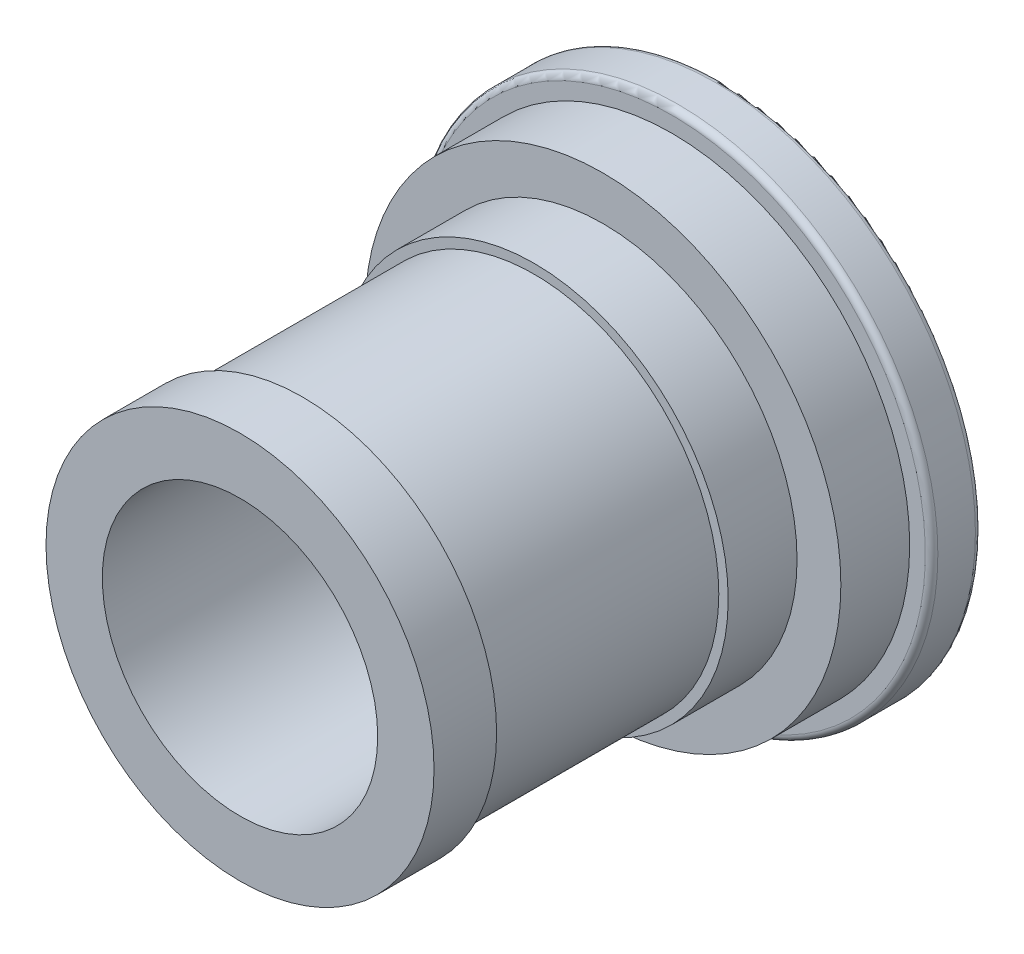
ISO-10303-21;
HEADER;
FILE_DESCRIPTION(('STEP AP214'),'2;1');
FILE_NAME('part.step','',(''),(''),'','','');
FILE_SCHEMA(('AUTOMOTIVE_DESIGN { 1 0 10303 214 1 1 1 1 }'));
ENDSEC;
DATA;
#1=APPLICATION_CONTEXT('core data for automotive mechanical design processes');
#2=APPLICATION_PROTOCOL_DEFINITION('international standard','automotive_design',2000,#1);
#3=PRODUCT_CONTEXT('',#1,'mechanical');
#4=PRODUCT('Part','Part','',(#3));
#5=PRODUCT_RELATED_PRODUCT_CATEGORY('part','',(#4));
#6=PRODUCT_DEFINITION_FORMATION('','',#4);
#7=PRODUCT_DEFINITION_CONTEXT('part definition',#1,'design');
#8=PRODUCT_DEFINITION('design','',#6,#7);
#9=PRODUCT_DEFINITION_SHAPE('','',#8);
#10=(LENGTH_UNIT() NAMED_UNIT(*) SI_UNIT(.MILLI.,.METRE.));
#11=(NAMED_UNIT(*) PLANE_ANGLE_UNIT() SI_UNIT($,.RADIAN.));
#12=(NAMED_UNIT(*) SI_UNIT($,.STERADIAN.) SOLID_ANGLE_UNIT());
#13=UNCERTAINTY_MEASURE_WITH_UNIT(LENGTH_MEASURE(1.E-05),#10,'distance_accuracy_value','');
#14=(GEOMETRIC_REPRESENTATION_CONTEXT(3) GLOBAL_UNCERTAINTY_ASSIGNED_CONTEXT((#13)) GLOBAL_UNIT_ASSIGNED_CONTEXT((#10,
#11,#12)) REPRESENTATION_CONTEXT('',''));
#15=CARTESIAN_POINT('',(0.,0.,0.));
#16=DIRECTION('',(0.,0.,1.));
#17=DIRECTION('',(1.,0.,0.));
#18=AXIS2_PLACEMENT_3D('',#15,#16,#17);
#19=CARTESIAN_POINT('',(-22.,0.,0.));
#20=DIRECTION('',(0.,0.,-1.));
#21=DIRECTION('',(-1.,0.,0.));
#22=AXIS2_PLACEMENT_3D('',#19,#20,#21);
#23=PLANE('',#22);
#24=CARTESIAN_POINT('',(0.,0.,0.));
#25=DIRECTION('',(0.,0.,1.));
#26=DIRECTION('',(1.,0.,0.));
#27=AXIS2_PLACEMENT_3D('',#24,#25,#26);
#28=CIRCLE('',#27,22.);
#29=CARTESIAN_POINT('',(22.,0.,0.));
#30=VERTEX_POINT('',#29);
#31=EDGE_CURVE('E78',#30,#30,#28,.T.);
#32=ORIENTED_EDGE('',*,*,#31,.F.);
#33=EDGE_LOOP('',(#32));
#34=FACE_BOUND('',#33,.T.);
#35=CARTESIAN_POINT('',(0.,0.,0.));
#36=DIRECTION('',(0.,0.,1.));
#37=DIRECTION('',(1.,0.,0.));
#38=AXIS2_PLACEMENT_3D('',#35,#36,#37);
#39=CIRCLE('',#38,31.);
#40=CARTESIAN_POINT('',(31.,0.,0.));
#41=VERTEX_POINT('',#40);
#42=EDGE_CURVE('E51',#41,#41,#39,.T.);
#43=ORIENTED_EDGE('',*,*,#42,.T.);
#44=EDGE_LOOP('',(#43));
#45=FACE_BOUND('',#44,.T.);
#46=ADVANCED_FACE('F31',(#34,#45),#23,.F.);
#47=CARTESIAN_POINT('',(0.,0.,0.));
#48=DIRECTION('',(0.,0.,1.));
#49=DIRECTION('',(1.,0.,0.));
#50=AXIS2_PLACEMENT_3D('',#47,#48,#49);
#51=CYLINDRICAL_SURFACE('',#50,31.);
#52=ORIENTED_EDGE('',*,*,#42,.F.);
#53=EDGE_LOOP('',(#52));
#54=FACE_BOUND('',#53,.T.);
#55=CARTESIAN_POINT('',(0.,0.,-9.99999999999999));
#56=DIRECTION('',(0.,0.,1.));
#57=DIRECTION('',(1.,0.,0.));
#58=AXIS2_PLACEMENT_3D('',#55,#56,#57);
#59=CIRCLE('',#58,31.);
#60=CARTESIAN_POINT('',(31.,0.,-9.99999999999999));
#61=VERTEX_POINT('',#60);
#62=EDGE_CURVE('E54',#61,#61,#59,.T.);
#63=ORIENTED_EDGE('',*,*,#62,.T.);
#64=EDGE_LOOP('',(#63));
#65=FACE_BOUND('',#64,.T.);
#66=ADVANCED_FACE('F86',(#54,#65),#51,.T.);
#67=CARTESIAN_POINT('',(-31.,0.,-9.99999999999999));
#68=DIRECTION('',(0.,0.,1.));
#69=DIRECTION('',(1.,0.,0.));
#70=AXIS2_PLACEMENT_3D('',#67,#68,#69);
#71=PLANE('',#70);
#72=ORIENTED_EDGE('',*,*,#62,.F.);
#73=EDGE_LOOP('',(#72));
#74=FACE_BOUND('',#73,.T.);
#75=CARTESIAN_POINT('',(0.,0.,-10.));
#76=DIRECTION('',(0.,0.,1.));
#77=DIRECTION('',(1.,0.,0.));
#78=AXIS2_PLACEMENT_3D('',#75,#76,#77);
#79=CIRCLE('',#78,29.5);
#80=CARTESIAN_POINT('',(29.5,0.,-10.));
#81=VERTEX_POINT('',#80);
#82=EDGE_CURVE('E57',#81,#81,#79,.T.);
#83=ORIENTED_EDGE('',*,*,#82,.T.);
#84=EDGE_LOOP('',(#83));
#85=FACE_BOUND('',#84,.T.);
#86=ADVANCED_FACE('F92',(#74,#85),#71,.F.);
#87=CARTESIAN_POINT('',(0.,0.,0.));
#88=DIRECTION('',(0.,0.,1.));
#89=DIRECTION('',(1.,0.,0.));
#90=AXIS2_PLACEMENT_3D('',#87,#88,#89);
#91=CYLINDRICAL_SURFACE('',#90,29.5);
#92=ORIENTED_EDGE('',*,*,#82,.F.);
#93=EDGE_LOOP('',(#92));
#94=FACE_BOUND('',#93,.T.);
#95=CARTESIAN_POINT('',(0.,0.,-47.));
#96=DIRECTION('',(0.,0.,1.));
#97=DIRECTION('',(1.,0.,0.));
#98=AXIS2_PLACEMENT_3D('',#95,#96,#97);
#99=CIRCLE('',#98,29.5);
#100=CARTESIAN_POINT('',(29.5,0.,-47.));
#101=VERTEX_POINT('',#100);
#102=EDGE_CURVE('E60',#101,#101,#99,.T.);
#103=ORIENTED_EDGE('',*,*,#102,.T.);
#104=EDGE_LOOP('',(#103));
#105=FACE_BOUND('',#104,.T.);
#106=ADVANCED_FACE('F98',(#94,#105),#91,.T.);
#107=CARTESIAN_POINT('',(-29.5,0.,-47.));
#108=DIRECTION('',(0.,0.,-1.));
#109=DIRECTION('',(-1.,0.,0.));
#110=AXIS2_PLACEMENT_3D('',#107,#108,#109);
#111=PLANE('',#110);
#112=ORIENTED_EDGE('',*,*,#102,.F.);
#113=EDGE_LOOP('',(#112));
#114=FACE_BOUND('',#113,.T.);
#115=CARTESIAN_POINT('',(0.,0.,-47.));
#116=DIRECTION('',(0.,0.,1.));
#117=DIRECTION('',(1.,0.,0.));
#118=AXIS2_PLACEMENT_3D('',#115,#116,#117);
#119=CIRCLE('',#118,31.);
#120=CARTESIAN_POINT('',(31.,0.,-47.));
#121=VERTEX_POINT('',#120);
#122=EDGE_CURVE('E63',#121,#121,#119,.T.);
#123=ORIENTED_EDGE('',*,*,#122,.T.);
#124=EDGE_LOOP('',(#123));
#125=FACE_BOUND('',#124,.T.);
#126=ADVANCED_FACE('F104',(#114,#125),#111,.F.);
#127=CARTESIAN_POINT('',(0.,0.,0.));
#128=DIRECTION('',(0.,0.,1.));
#129=DIRECTION('',(1.,0.,0.));
#130=AXIS2_PLACEMENT_3D('',#127,#128,#129);
#131=CYLINDRICAL_SURFACE('',#130,31.);
#132=ORIENTED_EDGE('',*,*,#122,.F.);
#133=EDGE_LOOP('',(#132));
#134=FACE_BOUND('',#133,.T.);
#135=CARTESIAN_POINT('',(0.,0.,-58.));
#136=DIRECTION('',(0.,0.,1.));
#137=DIRECTION('',(1.,0.,0.));
#138=AXIS2_PLACEMENT_3D('',#135,#136,#137);
#139=CIRCLE('',#138,31.);
#140=CARTESIAN_POINT('',(31.,0.,-58.));
#141=VERTEX_POINT('',#140);
#142=EDGE_CURVE('E66',#141,#141,#139,.T.);
#143=ORIENTED_EDGE('',*,*,#142,.T.);
#144=EDGE_LOOP('',(#143));
#145=FACE_BOUND('',#144,.T.);
#146=ADVANCED_FACE('F110',(#134,#145),#131,.T.);
#147=CARTESIAN_POINT('',(-31.,0.,-58.));
#148=DIRECTION('',(0.,0.,-1.));
#149=DIRECTION('',(-1.,0.,0.));
#150=AXIS2_PLACEMENT_3D('',#147,#148,#149);
#151=PLANE('',#150);
#152=ORIENTED_EDGE('',*,*,#142,.F.);
#153=EDGE_LOOP('',(#152));
#154=FACE_BOUND('',#153,.T.);
#155=CARTESIAN_POINT('',(0.,0.,-58.));
#156=DIRECTION('',(0.,0.,1.));
#157=DIRECTION('',(1.,0.,0.));
#158=AXIS2_PLACEMENT_3D('',#155,#156,#157);
#159=CIRCLE('',#158,38.);
#160=CARTESIAN_POINT('',(38.,0.,-58.));
#161=VERTEX_POINT('',#160);
#162=EDGE_CURVE('E69',#161,#161,#159,.T.);
#163=ORIENTED_EDGE('',*,*,#162,.T.);
#164=EDGE_LOOP('',(#163));
#165=FACE_BOUND('',#164,.T.);
#166=ADVANCED_FACE('F116',(#154,#165),#151,.F.);
#167=CARTESIAN_POINT('',(0.,0.,0.));
#168=DIRECTION('',(0.,0.,1.));
#169=DIRECTION('',(1.,0.,0.));
#170=AXIS2_PLACEMENT_3D('',#167,#168,#169);
#171=CYLINDRICAL_SURFACE('',#170,38.);
#172=ORIENTED_EDGE('',*,*,#162,.F.);
#173=EDGE_LOOP('',(#172));
#174=FACE_BOUND('',#173,.T.);
#175=CARTESIAN_POINT('',(0.,0.,-69.));
#176=DIRECTION('',(0.,0.,1.));
#177=DIRECTION('',(1.,0.,0.));
#178=AXIS2_PLACEMENT_3D('',#175,#176,#177);
#179=CIRCLE('',#178,38.);
#180=CARTESIAN_POINT('',(38.,0.,-69.));
#181=VERTEX_POINT('',#180);
#182=EDGE_CURVE('E72',#181,#181,#179,.T.);
#183=ORIENTED_EDGE('',*,*,#182,.T.);
#184=EDGE_LOOP('',(#183));
#185=FACE_BOUND('',#184,.T.);
#186=ADVANCED_FACE('F122',(#174,#185),#171,.T.);
#187=CARTESIAN_POINT('',(-38.,0.,-69.));
#188=DIRECTION('',(0.,0.,-1.));
#189=DIRECTION('',(-1.,0.,0.));
#190=AXIS2_PLACEMENT_3D('',#187,#188,#189);
#191=PLANE('',#190);
#192=CARTESIAN_POINT('',(0.,0.,-69.));
#193=DIRECTION('',(0.,0.,-1.));
#194=DIRECTION('',(-1.,0.,0.));
#195=AXIS2_PLACEMENT_3D('',#192,#193,#194);
#196=CIRCLE('',#195,40.5);
#197=CARTESIAN_POINT('',(-40.5,0.,-69.));
#198=VERTEX_POINT('',#197);
#199=EDGE_CURVE('E46',#198,#198,#196,.F.);
#200=ORIENTED_EDGE('',*,*,#199,.T.);
#201=EDGE_LOOP('',(#200));
#202=FACE_BOUND('',#201,.T.);
#203=ORIENTED_EDGE('',*,*,#182,.F.);
#204=EDGE_LOOP('',(#203));
#205=FACE_BOUND('',#204,.T.);
#206=ADVANCED_FACE('F128',(#202,#205),#191,.F.);
#207=CARTESIAN_POINT('',(0.,0.,0.));
#208=DIRECTION('',(0.,0.,1.));
#209=DIRECTION('',(1.,0.,0.));
#210=AXIS2_PLACEMENT_3D('',#207,#208,#209);
#211=CYLINDRICAL_SURFACE('',#210,41.5);
#212=CARTESIAN_POINT('',(0.,0.,-70.));
#213=DIRECTION('',(0.,0.,-1.));
#214=DIRECTION('',(-1.,0.,0.));
#215=AXIS2_PLACEMENT_3D('',#212,#213,#214);
#216=CIRCLE('',#215,41.5);
#217=CARTESIAN_POINT('',(-41.5,0.,-70.));
#218=VERTEX_POINT('',#217);
#219=EDGE_CURVE('E38',#218,#218,#216,.T.);
#220=ORIENTED_EDGE('',*,*,#219,.T.);
#221=EDGE_LOOP('',(#220));
#222=FACE_BOUND('',#221,.T.);
#223=CARTESIAN_POINT('',(0.,0.,-76.));
#224=DIRECTION('',(0.,0.,1.));
#225=DIRECTION('',(1.,0.,0.));
#226=AXIS2_PLACEMENT_3D('',#223,#224,#225);
#227=CIRCLE('',#226,41.5);
#228=CARTESIAN_POINT('',(41.5,0.,-76.));
#229=VERTEX_POINT('',#228);
#230=EDGE_CURVE('E42',#229,#229,#227,.T.);
#231=ORIENTED_EDGE('',*,*,#230,.T.);
#232=EDGE_LOOP('',(#231));
#233=FACE_BOUND('',#232,.T.);
#234=ADVANCED_FACE('F133',(#222,#233),#211,.T.);
#235=CARTESIAN_POINT('',(-41.5,0.,-77.));
#236=DIRECTION('',(0.,0.,1.));
#237=DIRECTION('',(1.,0.,0.));
#238=AXIS2_PLACEMENT_3D('',#235,#236,#237);
#239=PLANE('',#238);
#240=CARTESIAN_POINT('',(0.,0.,-77.));
#241=DIRECTION('',(0.,0.,1.));
#242=DIRECTION('',(1.,0.,0.));
#243=AXIS2_PLACEMENT_3D('',#240,#241,#242);
#244=CIRCLE('',#243,40.5);
#245=CARTESIAN_POINT('',(40.5,0.,-77.));
#246=VERTEX_POINT('',#245);
#247=EDGE_CURVE('E10',#246,#246,#244,.F.);
#248=ORIENTED_EDGE('',*,*,#247,.T.);
#249=EDGE_LOOP('',(#248));
#250=FACE_BOUND('',#249,.T.);
#251=CARTESIAN_POINT('',(0.,0.,-77.));
#252=DIRECTION('',(0.,0.,1.));
#253=DIRECTION('',(1.,0.,0.));
#254=AXIS2_PLACEMENT_3D('',#251,#252,#253);
#255=CIRCLE('',#254,22.);
#256=CARTESIAN_POINT('',(22.,0.,-77.));
#257=VERTEX_POINT('',#256);
#258=EDGE_CURVE('E75',#257,#257,#255,.T.);
#259=ORIENTED_EDGE('',*,*,#258,.T.);
#260=EDGE_LOOP('',(#259));
#261=FACE_BOUND('',#260,.T.);
#262=ADVANCED_FACE('F140',(#250,#261),#239,.F.);
#263=CARTESIAN_POINT('',(0.,0.,0.));
#264=DIRECTION('',(0.,0.,1.));
#265=DIRECTION('',(1.,0.,0.));
#266=AXIS2_PLACEMENT_3D('',#263,#264,#265);
#267=CYLINDRICAL_SURFACE('',#266,22.);
#268=ORIENTED_EDGE('',*,*,#258,.F.);
#269=EDGE_LOOP('',(#268));
#270=FACE_BOUND('',#269,.T.);
#271=ORIENTED_EDGE('',*,*,#31,.T.);
#272=EDGE_LOOP('',(#271));
#273=FACE_BOUND('',#272,.T.);
#274=ADVANCED_FACE('F82',(#270,#273),#267,.F.);
#275=CARTESIAN_POINT('',(0.,0.,-70.));
#276=DIRECTION('',(0.,0.,-1.));
#277=DIRECTION('',(-1.,0.,0.));
#278=AXIS2_PLACEMENT_3D('',#275,#276,#277);
#279=TOROIDAL_SURFACE('',#278,40.5,1.);
#280=ORIENTED_EDGE('',*,*,#219,.F.);
#281=EDGE_LOOP('',(#280));
#282=FACE_BOUND('',#281,.T.);
#283=ORIENTED_EDGE('',*,*,#199,.F.);
#284=EDGE_LOOP('',(#283));
#285=FACE_BOUND('',#284,.T.);
#286=ADVANCED_FACE('F143',(#282,#285),#279,.T.);
#287=CARTESIAN_POINT('',(0.,0.,-76.));
#288=DIRECTION('',(0.,0.,1.));
#289=DIRECTION('',(1.,0.,0.));
#290=AXIS2_PLACEMENT_3D('',#287,#288,#289);
#291=TOROIDAL_SURFACE('',#290,40.5,1.);
#292=ORIENTED_EDGE('',*,*,#247,.F.);
#293=EDGE_LOOP('',(#292));
#294=FACE_BOUND('',#293,.T.);
#295=ORIENTED_EDGE('',*,*,#230,.F.);
#296=EDGE_LOOP('',(#295));
#297=FACE_BOUND('',#296,.T.);
#298=ADVANCED_FACE('F33',(#294,#297),#291,.T.);
#299=CLOSED_SHELL('',(#46,#66,#86,#106,#126,#146,#166,#186,#206,#234,#262,#274,#286,#298));
#300=MANIFOLD_SOLID_BREP('B2',#299);
#301=ADVANCED_BREP_SHAPE_REPRESENTATION('',(#18,#300),#14);
#302=SHAPE_DEFINITION_REPRESENTATION(#9,#301);
ENDSEC;
END-ISO-10303-21;
